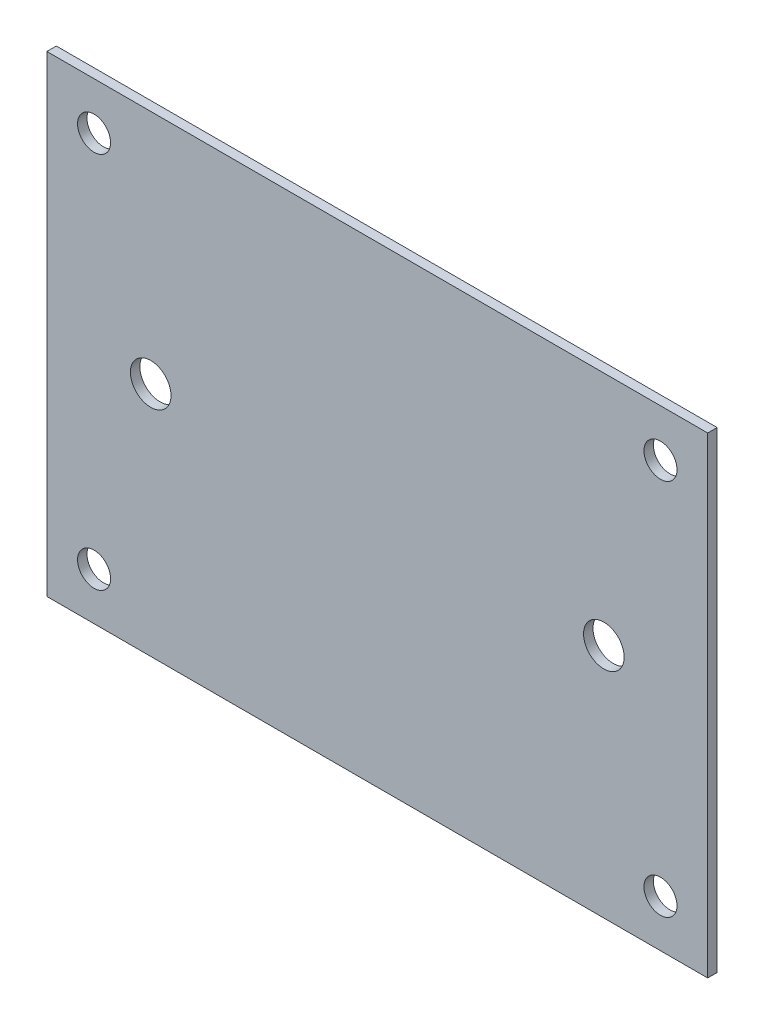
ISO-10303-21;
HEADER;
FILE_DESCRIPTION(('STEP AP214'),'2;1');
FILE_NAME('part.step','',(''),(''),'','','');
FILE_SCHEMA(('AUTOMOTIVE_DESIGN { 1 0 10303 214 1 1 1 1 }'));
ENDSEC;
DATA;
#1=APPLICATION_CONTEXT('core data for automotive mechanical design processes');
#2=APPLICATION_PROTOCOL_DEFINITION('international standard','automotive_design',2000,#1);
#3=PRODUCT_CONTEXT('',#1,'mechanical');
#4=PRODUCT('Part','Part','',(#3));
#5=PRODUCT_RELATED_PRODUCT_CATEGORY('part','',(#4));
#6=PRODUCT_DEFINITION_FORMATION('','',#4);
#7=PRODUCT_DEFINITION_CONTEXT('part definition',#1,'design');
#8=PRODUCT_DEFINITION('design','',#6,#7);
#9=PRODUCT_DEFINITION_SHAPE('','',#8);
#10=(LENGTH_UNIT() NAMED_UNIT(*) SI_UNIT(.MILLI.,.METRE.));
#11=(NAMED_UNIT(*) PLANE_ANGLE_UNIT() SI_UNIT($,.RADIAN.));
#12=(NAMED_UNIT(*) SI_UNIT($,.STERADIAN.) SOLID_ANGLE_UNIT());
#13=UNCERTAINTY_MEASURE_WITH_UNIT(LENGTH_MEASURE(1.E-05),#10,'distance_accuracy_value','');
#14=(GEOMETRIC_REPRESENTATION_CONTEXT(3) GLOBAL_UNCERTAINTY_ASSIGNED_CONTEXT((#13)) GLOBAL_UNIT_ASSIGNED_CONTEXT((#10,
#11,#12)) REPRESENTATION_CONTEXT('',''));
#15=CARTESIAN_POINT('',(0.,0.,0.));
#16=DIRECTION('',(0.,0.,1.));
#17=DIRECTION('',(1.,0.,0.));
#18=AXIS2_PLACEMENT_3D('',#15,#16,#17);
#19=CARTESIAN_POINT('',(0.,0.,0.));
#20=DIRECTION('',(0.,0.,1.));
#21=DIRECTION('',(1.,0.,0.));
#22=AXIS2_PLACEMENT_3D('',#19,#20,#21);
#23=PLANE('',#22);
#24=CARTESIAN_POINT('',(-30.,20.,0.));
#25=DIRECTION('',(0.,0.,1.));
#26=DIRECTION('',(1.,0.,0.));
#27=AXIS2_PLACEMENT_3D('',#24,#25,#26);
#28=CIRCLE('',#27,1.75);
#29=CARTESIAN_POINT('',(-28.25,20.,0.));
#30=VERTEX_POINT('',#29);
#31=EDGE_CURVE('E95',#30,#30,#28,.T.);
#32=ORIENTED_EDGE('',*,*,#31,.T.);
#33=EDGE_LOOP('',(#32));
#34=FACE_BOUND('',#33,.T.);
#35=CARTESIAN_POINT('',(30.,20.,0.));
#36=DIRECTION('',(0.,0.,1.));
#37=DIRECTION('',(1.,0.,0.));
#38=AXIS2_PLACEMENT_3D('',#35,#36,#37);
#39=CIRCLE('',#38,1.75);
#40=CARTESIAN_POINT('',(31.75,20.,0.));
#41=VERTEX_POINT('',#40);
#42=EDGE_CURVE('E99',#41,#41,#39,.T.);
#43=ORIENTED_EDGE('',*,*,#42,.T.);
#44=EDGE_LOOP('',(#43));
#45=FACE_BOUND('',#44,.T.);
#46=CARTESIAN_POINT('',(-30.,-20.,0.));
#47=DIRECTION('',(0.,0.,1.));
#48=DIRECTION('',(1.,0.,0.));
#49=AXIS2_PLACEMENT_3D('',#46,#47,#48);
#50=CIRCLE('',#49,1.75);
#51=CARTESIAN_POINT('',(-28.25,-20.,0.));
#52=VERTEX_POINT('',#51);
#53=EDGE_CURVE('E102',#52,#52,#50,.T.);
#54=ORIENTED_EDGE('',*,*,#53,.T.);
#55=EDGE_LOOP('',(#54));
#56=FACE_BOUND('',#55,.T.);
#57=CARTESIAN_POINT('',(30.,-20.,0.));
#58=DIRECTION('',(0.,0.,1.));
#59=DIRECTION('',(1.,0.,0.));
#60=AXIS2_PLACEMENT_3D('',#57,#58,#59);
#61=CIRCLE('',#60,1.75);
#62=CARTESIAN_POINT('',(31.75,-20.,0.));
#63=VERTEX_POINT('',#62);
#64=EDGE_CURVE('E105',#63,#63,#61,.T.);
#65=ORIENTED_EDGE('',*,*,#64,.T.);
#66=EDGE_LOOP('',(#65));
#67=FACE_BOUND('',#66,.T.);
#68=CARTESIAN_POINT('',(-24.,0.,0.));
#69=DIRECTION('',(0.,0.,1.));
#70=DIRECTION('',(1.,0.,0.));
#71=AXIS2_PLACEMENT_3D('',#68,#69,#70);
#72=CIRCLE('',#71,2.15);
#73=CARTESIAN_POINT('',(-21.85,0.,0.));
#74=VERTEX_POINT('',#73);
#75=EDGE_CURVE('E107',#74,#74,#72,.T.);
#76=ORIENTED_EDGE('',*,*,#75,.T.);
#77=EDGE_LOOP('',(#76));
#78=FACE_BOUND('',#77,.T.);
#79=CARTESIAN_POINT('',(24.,0.,0.));
#80=DIRECTION('',(0.,0.,1.));
#81=DIRECTION('',(1.,0.,0.));
#82=AXIS2_PLACEMENT_3D('',#79,#80,#81);
#83=CIRCLE('',#82,2.15);
#84=CARTESIAN_POINT('',(26.15,0.,0.));
#85=VERTEX_POINT('',#84);
#86=EDGE_CURVE('E19',#85,#85,#83,.T.);
#87=ORIENTED_EDGE('',*,*,#86,.T.);
#88=EDGE_LOOP('',(#87));
#89=FACE_BOUND('',#88,.T.);
#90=DIRECTION('',(0.,1.,0.));
#91=VECTOR('',#90,1.);
#92=CARTESIAN_POINT('',(35.,25.,0.));
#93=LINE('',#92,#91);
#94=CARTESIAN_POINT('',(35.,-25.,0.));
#95=VERTEX_POINT('',#94);
#96=CARTESIAN_POINT('',(35.,25.,0.));
#97=VERTEX_POINT('',#96);
#98=EDGE_CURVE('E59',#95,#97,#93,.T.);
#99=ORIENTED_EDGE('',*,*,#98,.F.);
#100=DIRECTION('',(1.,0.,0.));
#101=VECTOR('',#100,1.);
#102=CARTESIAN_POINT('',(35.,-25.,0.));
#103=LINE('',#102,#101);
#104=CARTESIAN_POINT('',(-35.,-25.,0.));
#105=VERTEX_POINT('',#104);
#106=EDGE_CURVE('E114',#105,#95,#103,.T.);
#107=ORIENTED_EDGE('',*,*,#106,.F.);
#108=DIRECTION('',(0.,-1.,0.));
#109=VECTOR('',#108,1.);
#110=CARTESIAN_POINT('',(-35.,-25.,0.));
#111=LINE('',#110,#109);
#112=CARTESIAN_POINT('',(-35.,25.,0.));
#113=VERTEX_POINT('',#112);
#114=EDGE_CURVE('E69',#113,#105,#111,.T.);
#115=ORIENTED_EDGE('',*,*,#114,.F.);
#116=DIRECTION('',(1.,0.,0.));
#117=VECTOR('',#116,1.);
#118=CARTESIAN_POINT('',(-35.,25.,0.));
#119=LINE('',#118,#117);
#120=EDGE_CURVE('E54',#97,#113,#119,.F.);
#121=ORIENTED_EDGE('',*,*,#120,.F.);
#122=EDGE_LOOP('',(#99,#107,#115,#121));
#123=FACE_BOUND('',#122,.T.);
#124=ADVANCED_FACE('F16',(#34,#45,#56,#67,#78,#89,#123),#23,.F.);
#125=CARTESIAN_POINT('',(35.,25.,0.));
#126=DIRECTION('',(1.,0.,0.));
#127=DIRECTION('',(0.,0.,-1.));
#128=AXIS2_PLACEMENT_3D('',#125,#126,#127);
#129=PLANE('',#128);
#130=ORIENTED_EDGE('',*,*,#98,.T.);
#131=DIRECTION('',(0.,0.,1.));
#132=VECTOR('',#131,1.);
#133=CARTESIAN_POINT('',(35.,25.,0.));
#134=LINE('',#133,#132);
#135=CARTESIAN_POINT('',(35.,25.,1.));
#136=VERTEX_POINT('',#135);
#137=EDGE_CURVE('E61',#136,#97,#134,.F.);
#138=ORIENTED_EDGE('',*,*,#137,.F.);
#139=DIRECTION('',(0.,1.,0.));
#140=VECTOR('',#139,1.);
#141=CARTESIAN_POINT('',(35.,0.,1.));
#142=LINE('',#141,#140);
#143=CARTESIAN_POINT('',(35.,-25.,1.));
#144=VERTEX_POINT('',#143);
#145=EDGE_CURVE('E98',#144,#136,#142,.T.);
#146=ORIENTED_EDGE('',*,*,#145,.F.);
#147=DIRECTION('',(0.,0.,1.));
#148=VECTOR('',#147,1.);
#149=CARTESIAN_POINT('',(35.,-25.,0.));
#150=LINE('',#149,#148);
#151=EDGE_CURVE('E64',#95,#144,#150,.T.);
#152=ORIENTED_EDGE('',*,*,#151,.F.);
#153=EDGE_LOOP('',(#130,#138,#146,#152));
#154=FACE_BOUND('',#153,.T.);
#155=ADVANCED_FACE('F60',(#154),#129,.T.);
#156=CARTESIAN_POINT('',(-35.,25.,0.));
#157=DIRECTION('',(0.,1.,0.));
#158=DIRECTION('',(0.,0.,1.));
#159=AXIS2_PLACEMENT_3D('',#156,#157,#158);
#160=PLANE('',#159);
#161=ORIENTED_EDGE('',*,*,#120,.T.);
#162=DIRECTION('',(0.,0.,1.));
#163=VECTOR('',#162,1.);
#164=CARTESIAN_POINT('',(-35.,25.,0.));
#165=LINE('',#164,#163);
#166=CARTESIAN_POINT('',(-35.,25.,1.));
#167=VERTEX_POINT('',#166);
#168=EDGE_CURVE('E71',#167,#113,#165,.F.);
#169=ORIENTED_EDGE('',*,*,#168,.F.);
#170=DIRECTION('',(1.,0.,0.));
#171=VECTOR('',#170,1.);
#172=CARTESIAN_POINT('',(0.,25.,1.));
#173=LINE('',#172,#171);
#174=EDGE_CURVE('E75',#136,#167,#173,.F.);
#175=ORIENTED_EDGE('',*,*,#174,.F.);
#176=ORIENTED_EDGE('',*,*,#137,.T.);
#177=EDGE_LOOP('',(#161,#169,#175,#176));
#178=FACE_BOUND('',#177,.T.);
#179=ADVANCED_FACE('F73',(#178),#160,.T.);
#180=CARTESIAN_POINT('',(-35.,-25.,0.));
#181=DIRECTION('',(-1.,0.,0.));
#182=DIRECTION('',(0.,-1.,0.));
#183=AXIS2_PLACEMENT_3D('',#180,#181,#182);
#184=PLANE('',#183);
#185=ORIENTED_EDGE('',*,*,#114,.T.);
#186=DIRECTION('',(0.,0.,1.));
#187=VECTOR('',#186,1.);
#188=CARTESIAN_POINT('',(-35.,-25.,0.));
#189=LINE('',#188,#187);
#190=CARTESIAN_POINT('',(-35.,-25.,1.));
#191=VERTEX_POINT('',#190);
#192=EDGE_CURVE('E34',#191,#105,#189,.F.);
#193=ORIENTED_EDGE('',*,*,#192,.F.);
#194=DIRECTION('',(0.,1.,0.));
#195=VECTOR('',#194,1.);
#196=CARTESIAN_POINT('',(-35.,0.,1.));
#197=LINE('',#196,#195);
#198=EDGE_CURVE('E125',#167,#191,#197,.F.);
#199=ORIENTED_EDGE('',*,*,#198,.F.);
#200=ORIENTED_EDGE('',*,*,#168,.T.);
#201=EDGE_LOOP('',(#185,#193,#199,#200));
#202=FACE_BOUND('',#201,.T.);
#203=ADVANCED_FACE('F123',(#202),#184,.T.);
#204=CARTESIAN_POINT('',(35.,-25.,0.));
#205=DIRECTION('',(0.,-1.,0.));
#206=DIRECTION('',(1.,0.,0.));
#207=AXIS2_PLACEMENT_3D('',#204,#205,#206);
#208=PLANE('',#207);
#209=ORIENTED_EDGE('',*,*,#106,.T.);
#210=ORIENTED_EDGE('',*,*,#151,.T.);
#211=DIRECTION('',(1.,0.,0.));
#212=VECTOR('',#211,1.);
#213=CARTESIAN_POINT('',(0.,-25.,1.));
#214=LINE('',#213,#212);
#215=EDGE_CURVE('E94',#191,#144,#214,.T.);
#216=ORIENTED_EDGE('',*,*,#215,.F.);
#217=ORIENTED_EDGE('',*,*,#192,.T.);
#218=EDGE_LOOP('',(#209,#210,#216,#217));
#219=FACE_BOUND('',#218,.T.);
#220=ADVANCED_FACE('F130',(#219),#208,.T.);
#221=CARTESIAN_POINT('',(24.,0.,0.));
#222=DIRECTION('',(0.,0.,1.));
#223=DIRECTION('',(1.,0.,0.));
#224=AXIS2_PLACEMENT_3D('',#221,#222,#223);
#225=CYLINDRICAL_SURFACE('',#224,2.15);
#226=CARTESIAN_POINT('',(24.,0.,1.));
#227=DIRECTION('',(0.,0.,1.));
#228=DIRECTION('',(1.,0.,0.));
#229=AXIS2_PLACEMENT_3D('',#226,#227,#228);
#230=CIRCLE('',#229,2.15);
#231=CARTESIAN_POINT('',(26.15,0.,1.));
#232=VERTEX_POINT('',#231);
#233=EDGE_CURVE('E91',#232,#232,#230,.F.);
#234=ORIENTED_EDGE('',*,*,#233,.F.);
#235=EDGE_LOOP('',(#234));
#236=FACE_BOUND('',#235,.T.);
#237=ORIENTED_EDGE('',*,*,#86,.F.);
#238=EDGE_LOOP('',(#237));
#239=FACE_BOUND('',#238,.T.);
#240=ADVANCED_FACE('F132',(#236,#239),#225,.F.);
#241=CARTESIAN_POINT('',(-24.,0.,0.));
#242=DIRECTION('',(0.,0.,1.));
#243=DIRECTION('',(1.,0.,0.));
#244=AXIS2_PLACEMENT_3D('',#241,#242,#243);
#245=CYLINDRICAL_SURFACE('',#244,2.15);
#246=CARTESIAN_POINT('',(-24.,0.,1.));
#247=DIRECTION('',(0.,0.,1.));
#248=DIRECTION('',(1.,0.,0.));
#249=AXIS2_PLACEMENT_3D('',#246,#247,#248);
#250=CIRCLE('',#249,2.15);
#251=CARTESIAN_POINT('',(-21.85,0.,1.));
#252=VERTEX_POINT('',#251);
#253=EDGE_CURVE('E88',#252,#252,#250,.F.);
#254=ORIENTED_EDGE('',*,*,#253,.F.);
#255=EDGE_LOOP('',(#254));
#256=FACE_BOUND('',#255,.T.);
#257=ORIENTED_EDGE('',*,*,#75,.F.);
#258=EDGE_LOOP('',(#257));
#259=FACE_BOUND('',#258,.T.);
#260=ADVANCED_FACE('F139',(#256,#259),#245,.F.);
#261=CARTESIAN_POINT('',(30.,-20.,0.));
#262=DIRECTION('',(0.,0.,1.));
#263=DIRECTION('',(1.,0.,0.));
#264=AXIS2_PLACEMENT_3D('',#261,#262,#263);
#265=CYLINDRICAL_SURFACE('',#264,1.75);
#266=CARTESIAN_POINT('',(30.,-20.,1.));
#267=DIRECTION('',(0.,0.,1.));
#268=DIRECTION('',(1.,0.,0.));
#269=AXIS2_PLACEMENT_3D('',#266,#267,#268);
#270=CIRCLE('',#269,1.75);
#271=CARTESIAN_POINT('',(31.75,-20.,1.));
#272=VERTEX_POINT('',#271);
#273=EDGE_CURVE('E85',#272,#272,#270,.F.);
#274=ORIENTED_EDGE('',*,*,#273,.F.);
#275=EDGE_LOOP('',(#274));
#276=FACE_BOUND('',#275,.T.);
#277=ORIENTED_EDGE('',*,*,#64,.F.);
#278=EDGE_LOOP('',(#277));
#279=FACE_BOUND('',#278,.T.);
#280=ADVANCED_FACE('F161',(#276,#279),#265,.F.);
#281=CARTESIAN_POINT('',(-30.,-20.,0.));
#282=DIRECTION('',(0.,0.,1.));
#283=DIRECTION('',(1.,0.,0.));
#284=AXIS2_PLACEMENT_3D('',#281,#282,#283);
#285=CYLINDRICAL_SURFACE('',#284,1.75);
#286=CARTESIAN_POINT('',(-30.,-20.,1.));
#287=DIRECTION('',(0.,0.,1.));
#288=DIRECTION('',(1.,0.,0.));
#289=AXIS2_PLACEMENT_3D('',#286,#287,#288);
#290=CIRCLE('',#289,1.75);
#291=CARTESIAN_POINT('',(-28.25,-20.,1.));
#292=VERTEX_POINT('',#291);
#293=EDGE_CURVE('E82',#292,#292,#290,.F.);
#294=ORIENTED_EDGE('',*,*,#293,.F.);
#295=EDGE_LOOP('',(#294));
#296=FACE_BOUND('',#295,.T.);
#297=ORIENTED_EDGE('',*,*,#53,.F.);
#298=EDGE_LOOP('',(#297));
#299=FACE_BOUND('',#298,.T.);
#300=ADVANCED_FACE('F157',(#296,#299),#285,.F.);
#301=CARTESIAN_POINT('',(30.,20.,0.));
#302=DIRECTION('',(0.,0.,1.));
#303=DIRECTION('',(1.,0.,0.));
#304=AXIS2_PLACEMENT_3D('',#301,#302,#303);
#305=CYLINDRICAL_SURFACE('',#304,1.75);
#306=CARTESIAN_POINT('',(30.,20.,1.));
#307=DIRECTION('',(0.,0.,1.));
#308=DIRECTION('',(1.,0.,0.));
#309=AXIS2_PLACEMENT_3D('',#306,#307,#308);
#310=CIRCLE('',#309,1.75);
#311=CARTESIAN_POINT('',(31.75,20.,1.));
#312=VERTEX_POINT('',#311);
#313=EDGE_CURVE('E25',#312,#312,#310,.F.);
#314=ORIENTED_EDGE('',*,*,#313,.F.);
#315=EDGE_LOOP('',(#314));
#316=FACE_BOUND('',#315,.T.);
#317=ORIENTED_EDGE('',*,*,#42,.F.);
#318=EDGE_LOOP('',(#317));
#319=FACE_BOUND('',#318,.T.);
#320=ADVANCED_FACE('F150',(#316,#319),#305,.F.);
#321=CARTESIAN_POINT('',(-30.,20.,0.));
#322=DIRECTION('',(0.,0.,1.));
#323=DIRECTION('',(1.,0.,0.));
#324=AXIS2_PLACEMENT_3D('',#321,#322,#323);
#325=CYLINDRICAL_SURFACE('',#324,1.75);
#326=CARTESIAN_POINT('',(-30.,20.,1.));
#327=DIRECTION('',(0.,0.,1.));
#328=DIRECTION('',(1.,0.,0.));
#329=AXIS2_PLACEMENT_3D('',#326,#327,#328);
#330=CIRCLE('',#329,1.75);
#331=CARTESIAN_POINT('',(-28.25,20.,1.));
#332=VERTEX_POINT('',#331);
#333=EDGE_CURVE('E11',#332,#332,#330,.F.);
#334=ORIENTED_EDGE('',*,*,#333,.F.);
#335=EDGE_LOOP('',(#334));
#336=FACE_BOUND('',#335,.T.);
#337=ORIENTED_EDGE('',*,*,#31,.F.);
#338=EDGE_LOOP('',(#337));
#339=FACE_BOUND('',#338,.T.);
#340=ADVANCED_FACE('F144',(#336,#339),#325,.F.);
#341=CARTESIAN_POINT('',(0.,0.,1.));
#342=DIRECTION('',(0.,0.,1.));
#343=DIRECTION('',(1.,0.,0.));
#344=AXIS2_PLACEMENT_3D('',#341,#342,#343);
#345=PLANE('',#344);
#346=ORIENTED_EDGE('',*,*,#333,.T.);
#347=EDGE_LOOP('',(#346));
#348=FACE_BOUND('',#347,.T.);
#349=ORIENTED_EDGE('',*,*,#313,.T.);
#350=EDGE_LOOP('',(#349));
#351=FACE_BOUND('',#350,.T.);
#352=ORIENTED_EDGE('',*,*,#293,.T.);
#353=EDGE_LOOP('',(#352));
#354=FACE_BOUND('',#353,.T.);
#355=ORIENTED_EDGE('',*,*,#273,.T.);
#356=EDGE_LOOP('',(#355));
#357=FACE_BOUND('',#356,.T.);
#358=ORIENTED_EDGE('',*,*,#253,.T.);
#359=EDGE_LOOP('',(#358));
#360=FACE_BOUND('',#359,.T.);
#361=ORIENTED_EDGE('',*,*,#233,.T.);
#362=EDGE_LOOP('',(#361));
#363=FACE_BOUND('',#362,.T.);
#364=ORIENTED_EDGE('',*,*,#198,.T.);
#365=ORIENTED_EDGE('',*,*,#215,.T.);
#366=ORIENTED_EDGE('',*,*,#145,.T.);
#367=ORIENTED_EDGE('',*,*,#174,.T.);
#368=EDGE_LOOP('',(#364,#365,#366,#367));
#369=FACE_BOUND('',#368,.T.);
#370=ADVANCED_FACE('F128',(#348,#351,#354,#357,#360,#363,#369),#345,.T.);
#371=CLOSED_SHELL('',(#124,#155,#179,#203,#220,#240,#260,#280,#300,#320,#340,#370));
#372=MANIFOLD_SOLID_BREP('B1',#371);
#373=ADVANCED_BREP_SHAPE_REPRESENTATION('',(#18,#372),#14);
#374=SHAPE_DEFINITION_REPRESENTATION(#9,#373);
ENDSEC;
END-ISO-10303-21;
